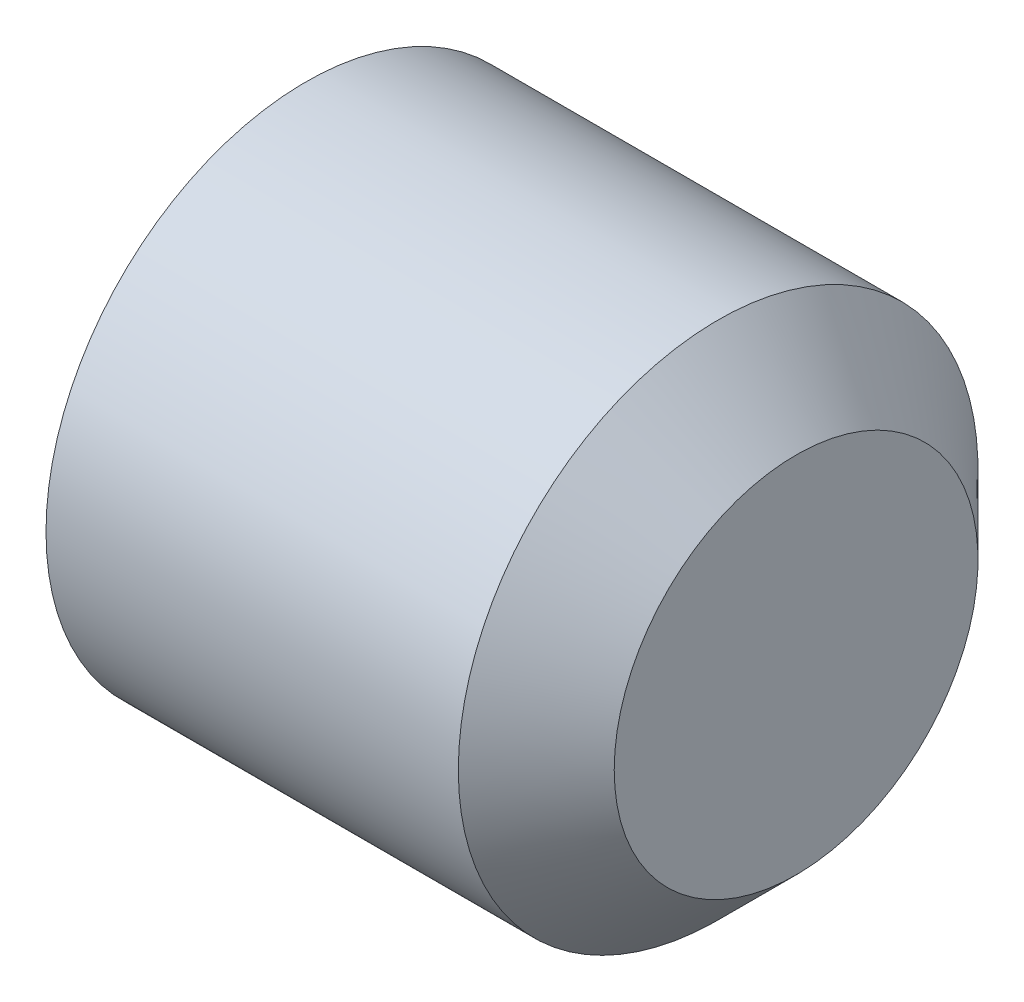
ISO-10303-21;
HEADER;
FILE_DESCRIPTION(('STEP AP214'),'2;1');
FILE_NAME('part.step','',(''),(''),'','','');
FILE_SCHEMA(('AUTOMOTIVE_DESIGN { 1 0 10303 214 1 1 1 1 }'));
ENDSEC;
DATA;
#1=APPLICATION_CONTEXT('core data for automotive mechanical design processes');
#2=APPLICATION_PROTOCOL_DEFINITION('international standard','automotive_design',2000,#1);
#3=PRODUCT_CONTEXT('',#1,'mechanical');
#4=PRODUCT('Part','Part','',(#3));
#5=PRODUCT_RELATED_PRODUCT_CATEGORY('part','',(#4));
#6=PRODUCT_DEFINITION_FORMATION('','',#4);
#7=PRODUCT_DEFINITION_CONTEXT('part definition',#1,'design');
#8=PRODUCT_DEFINITION('design','',#6,#7);
#9=PRODUCT_DEFINITION_SHAPE('','',#8);
#10=(LENGTH_UNIT() NAMED_UNIT(*) SI_UNIT(.MILLI.,.METRE.));
#11=(NAMED_UNIT(*) PLANE_ANGLE_UNIT() SI_UNIT($,.RADIAN.));
#12=(NAMED_UNIT(*) SI_UNIT($,.STERADIAN.) SOLID_ANGLE_UNIT());
#13=UNCERTAINTY_MEASURE_WITH_UNIT(LENGTH_MEASURE(1.E-05),#10,'distance_accuracy_value','');
#14=(GEOMETRIC_REPRESENTATION_CONTEXT(3) GLOBAL_UNCERTAINTY_ASSIGNED_CONTEXT((#13)) GLOBAL_UNIT_ASSIGNED_CONTEXT((#10,
#11,#12)) REPRESENTATION_CONTEXT('',''));
#15=CARTESIAN_POINT('',(0.,0.,0.));
#16=DIRECTION('',(0.,0.,1.));
#17=DIRECTION('',(1.,0.,0.));
#18=AXIS2_PLACEMENT_3D('',#15,#16,#17);
#19=CARTESIAN_POINT('',(0.83333333333333,0.,0.));
#20=DIRECTION('',(-1.,0.,0.));
#21=DIRECTION('',(0.,0.,1.));
#22=AXIS2_PLACEMENT_3D('',#19,#20,#21);
#23=CONICAL_SURFACE('',#22,0.,1.04719755119661);
#24=CARTESIAN_POINT('',(0.,0.,0.));
#25=DIRECTION('',(-1.,0.,0.));
#26=DIRECTION('',(0.,0.,1.));
#27=AXIS2_PLACEMENT_3D('',#24,#25,#26);
#28=CIRCLE('',#27,1.4433756729741);
#29=CARTESIAN_POINT('',(0.,0.,1.4433756729741));
#30=VERTEX_POINT('',#29);
#31=CARTESIAN_POINT('',(0.,1.25000000000003,0.721687836487051));
#32=VERTEX_POINT('',#31);
#33=EDGE_CURVE('E135',#30,#32,#28,.T.);
#34=ORIENTED_EDGE('',*,*,#33,.T.);
#35=CARTESIAN_POINT('',(-6.66746660219313E-05,1.25020000000002,0.721572366433221));
#36=CARTESIAN_POINT('',(0.0182540852363146,1.19526669476825,0.753288124996257));
#37=CARTESIAN_POINT('',(0.0349166937993671,1.13985921349977,0.78527764922173));
#38=CARTESIAN_POINT('',(0.0640026960542333,1.02808463239967,0.849810733708432));
#39=CARTESIAN_POINT('',(0.0764157980239526,0.971715545158301,0.882355441401211));
#40=CARTESIAN_POINT('',(0.0957403123639898,0.859676025913025,0.947041487997347));
#41=CARTESIAN_POINT('',(0.102780310552569,0.804022841540779,0.979172868975923));
#42=CARTESIAN_POINT('',(0.111187567369367,0.692454346091615,1.04358696985658));
#43=CARTESIAN_POINT('',(0.112561784795276,0.636539441062406,1.07586945532691));
#44=CARTESIAN_POINT('',(0.109716662632079,0.532042078818279,1.13620103554816));
#45=CARTESIAN_POINT('',(0.106195901179983,0.483444050118688,1.16425912049995));
#46=CARTESIAN_POINT('',(0.0950328873007429,0.386564637826765,1.22019247526563));
#47=CARTESIAN_POINT('',(0.0873868144273217,0.33828358980784,1.24806755133611));
#48=CARTESIAN_POINT('',(0.0682705452994674,0.241204116145959,1.30411641158758));
#49=CARTESIAN_POINT('',(0.0567192430203415,0.192417989648102,1.33228309485384));
#50=CARTESIAN_POINT('',(0.0305016853061078,0.095573747707899,1.38819614400748));
#51=CARTESIAN_POINT('',(0.0158415978608937,0.0475143896730363,1.41594322730599));
#52=CARTESIAN_POINT('',(-6.66746660267736E-05,-0.000200000000000035,1.44349114302794));
#53=B_SPLINE_CURVE_WITH_KNOTS('',3,(#35,#36,#37,#38,#39,#40,#41,#42,#43,#44,#45,#46,#47,#48,#49,
#50,#51,#52),.UNSPECIFIED.,.F.,.F.,(4,2,2,2,2,2,2,2,4),(0.,0.198150821029562,0.396778196315227,
0.590488617354409,0.783961049317194,0.95248005639866,1.12115539730011,1.29357430343591,
1.46565426976932),.UNSPECIFIED.);
#54=EDGE_CURVE('E11',#32,#30,#53,.T.);
#55=ORIENTED_EDGE('',*,*,#54,.T.);
#56=EDGE_LOOP('',(#34,#55));
#57=FACE_BOUND('',#56,.T.);
#58=ADVANCED_FACE('F36',(#57),#23,.F.);
#59=CARTESIAN_POINT('',(0.,-1.25000000000002,0.721687836487058));
#60=VERTEX_POINT('',#59);
#61=EDGE_CURVE('E134',#60,#30,#28,.T.);
#62=ORIENTED_EDGE('',*,*,#61,.T.);
#63=CARTESIAN_POINT('',(-6.66746660268099E-05,0.000199999999999981,1.44349114302794));
#64=CARTESIAN_POINT('',(0.0182540852363098,-0.0547333052317663,1.4117753844649));
#65=CARTESIAN_POINT('',(0.0349166937993627,-0.110140786500242,1.37978586023943));
#66=CARTESIAN_POINT('',(0.06400269605423,-0.221915367600345,1.31525277575273));
#67=CARTESIAN_POINT('',(0.0764157980239499,-0.278284454841716,1.28270806805995));
#68=CARTESIAN_POINT('',(0.0957403123639879,-0.390323974086993,1.21802202146381));
#69=CARTESIAN_POINT('',(0.102780310552568,-0.445977158459239,1.18589064048523));
#70=CARTESIAN_POINT('',(0.111187567369366,-0.557545653908403,1.12147653960458));
#71=CARTESIAN_POINT('',(0.112561784795275,-0.613460558937613,1.08919405413425));
#72=CARTESIAN_POINT('',(0.10971666263208,-0.717957921181739,1.028862473913));
#73=CARTESIAN_POINT('',(0.106195901179984,-0.76655594988133,1.0008043889612));
#74=CARTESIAN_POINT('',(0.0950328873007448,-0.863435362173253,0.94487103419553));
#75=CARTESIAN_POINT('',(0.087386814427324,-0.911716410192178,0.916995958125047));
#76=CARTESIAN_POINT('',(0.0682705452994706,-1.00879588385406,0.860947097873573));
#77=CARTESIAN_POINT('',(0.0567192430203451,-1.05758201035191,0.832780414607316));
#78=CARTESIAN_POINT('',(0.0305016853061119,-1.15442625229212,0.776867365453675));
#79=CARTESIAN_POINT('',(0.0158415978608981,-1.20248561032698,0.749120282155167));
#80=CARTESIAN_POINT('',(-6.66746660219481E-05,-1.25020000000002,0.721572366433221));
#81=B_SPLINE_CURVE_WITH_KNOTS('',3,(#63,#64,#65,#66,#67,#68,#69,#70,#71,#72,#73,#74,#75,#76,#77,
#78,#79,#80),.UNSPECIFIED.,.F.,.F.,(4,2,2,2,2,2,2,2,4),(0.,0.198150821029564,0.396778196315229,
0.590488617354412,0.783961049317198,0.952480056398663,1.12115539730011,1.29357430343592,
1.46565426976932),.UNSPECIFIED.);
#82=EDGE_CURVE('E50',#30,#60,#81,.T.);
#83=ORIENTED_EDGE('',*,*,#82,.T.);
#84=EDGE_LOOP('',(#62,#83));
#85=FACE_BOUND('',#84,.T.);
#86=ADVANCED_FACE('F210',(#85),#23,.F.);
#87=CARTESIAN_POINT('',(0.,-1.25000000000002,-0.721687836487002));
#88=VERTEX_POINT('',#87);
#89=EDGE_CURVE('E238',#88,#60,#28,.T.);
#90=ORIENTED_EDGE('',*,*,#89,.T.);
#91=CARTESIAN_POINT('',(-0.464794110924291,-1.25000000000002,-1.86893140179214));
#92=CARTESIAN_POINT('',(-0.438896838466478,-1.25000000000002,-1.81495202267021));
#93=CARTESIAN_POINT('',(-0.413268621931145,-1.25000000000002,-1.76084125344193));
#94=CARTESIAN_POINT('',(-0.362702760613349,-1.25000000000002,-1.65228662652063));
#95=CARTESIAN_POINT('',(-0.33776524011027,-1.25000000000002,-1.59784271100764));
#96=CARTESIAN_POINT('',(-0.288593916349793,-1.25000000000002,-1.48823931692672));
#97=CARTESIAN_POINT('',(-0.264365299486762,-1.25000000000002,-1.43307750108904));
#98=CARTESIAN_POINT('',(-0.216995070503878,-1.25000000000002,-1.32229188443617));
#99=CARTESIAN_POINT('',(-0.193853401864485,-1.25000000000002,-1.26666810781958));
#100=CARTESIAN_POINT('',(-0.148354613067776,-1.25000000000002,-1.15340083047604));
#101=CARTESIAN_POINT('',(-0.126033815465273,-1.25000000000002,-1.09574254265112));
#102=CARTESIAN_POINT('',(-0.0832554769119631,-1.25000000000002,-0.979741082890144));
#103=CARTESIAN_POINT('',(-0.0627981694396674,-1.25000000000002,-0.921397826164608));
#104=CARTESIAN_POINT('',(-0.0050842376761978,-1.25000000000002,-0.745435524772212));
#105=CARTESIAN_POINT('',(0.0286497850231123,-1.25000000000002,-0.626561938132833));
#106=CARTESIAN_POINT('',(0.0677795931717858,-1.25000000000002,-0.445873083681213));
#107=CARTESIAN_POINT('',(0.0789059393811671,-1.25000000000002,-0.385304700192742));
#108=CARTESIAN_POINT('',(0.0965721477324202,-1.25000000000002,-0.263486592065004));
#109=CARTESIAN_POINT('',(0.103112319816829,-1.25000000000002,-0.20223691375322));
#110=CARTESIAN_POINT('',(0.111001218957217,-1.25000000000002,-0.0801324468775579));
#111=CARTESIAN_POINT('',(0.112411208741836,-1.25000000000002,-0.0192817197886894));
#112=CARTESIAN_POINT('',(0.110083812113801,-1.25000000000002,0.10231923270118));
#113=CARTESIAN_POINT('',(0.106346106973961,-1.25000000000002,0.163069451645888));
#114=CARTESIAN_POINT('',(0.0911019719638621,-1.25000000000002,0.312961598922957));
#115=CARTESIAN_POINT('',(0.0767387515703043,-1.25000000000002,0.401813055628298));
#116=CARTESIAN_POINT('',(0.0397001504850595,-1.25000000000002,0.577788146583247));
#117=CARTESIAN_POINT('',(0.0170147516458518,-1.25000000000002,0.664909564430803));
#118=CARTESIAN_POINT('',(-0.0217374532821383,-1.25000000000002,0.795209224728854));
#119=CARTESIAN_POINT('',(-0.035622944810274,-1.25000000000002,0.839061001813599));
#120=CARTESIAN_POINT('',(-0.0646784153621271,-1.25000000000002,0.926308087474023));
#121=CARTESIAN_POINT('',(-0.0798475927664454,-1.25000000000002,0.969703662172532));
#122=CARTESIAN_POINT('',(-0.111250133996567,-1.25000000000002,1.05609633508801));
#123=CARTESIAN_POINT('',(-0.127483304422994,-1.25000000000002,1.09909350410941));
#124=CARTESIAN_POINT('',(-0.160838243910796,-1.25000000000002,1.18474903910488));
#125=CARTESIAN_POINT('',(-0.177960163104354,-1.25000000000002,1.22740734642408));
#126=CARTESIAN_POINT('',(-0.222761429232148,-1.25000000000002,1.33629459550834));
#127=CARTESIAN_POINT('',(-0.250969383573535,-1.25000000000002,1.40230581092037));
#128=CARTESIAN_POINT('',(-0.308745081158495,-1.25000000000002,1.53373213594221));
#129=CARTESIAN_POINT('',(-0.338312926269929,-1.25000000000002,1.59914720045383));
#130=CARTESIAN_POINT('',(-0.428576920024401,-1.25000000000002,1.79469680395951));
#131=CARTESIAN_POINT('',(-0.490824273185201,-1.25000000000002,1.92411390982377));
#132=CARTESIAN_POINT('',(-0.617929622902747,-1.25000000000002,2.18184246876945));
#133=CARTESIAN_POINT('',(-0.682790734765051,-1.25000000000002,2.3101523670367));
#134=CARTESIAN_POINT('',(-0.814180745531451,-1.25000000000002,2.56589305685464));
#135=CARTESIAN_POINT('',(-0.88070943244268,-1.25000000000002,2.69332395754896));
#136=CARTESIAN_POINT('',(-1.00858200164583,-1.25000000000002,2.9355782630183));
#137=CARTESIAN_POINT('',(-1.06982257041218,-1.25000000000002,3.05045639113084));
#138=CARTESIAN_POINT('',(-1.19300148004091,-1.25000000000002,3.27984311898864));
#139=CARTESIAN_POINT('',(-1.25493984672615,-1.25000000000002,3.39435170485547));
#140=CARTESIAN_POINT('',(-1.37918115605613,-1.25000000000002,3.62279327872177));
#141=CARTESIAN_POINT('',(-1.44148277067595,-1.25000000000002,3.73672698995322));
#142=CARTESIAN_POINT('',(-1.56649149193147,-1.25000000000002,3.96436406629504));
#143=CARTESIAN_POINT('',(-1.62919857717611,-1.25000000000002,4.07806744314797));
#144=CARTESIAN_POINT('',(-1.69205434936231,-1.25000000000002,4.19168806612963));
#145=B_SPLINE_CURVE_WITH_KNOTS('',3,(#91,#92,#93,#94,#95,#96,#97,#98,#99,#100,#101,#102,#103,
#104,#105,#106,#107,#108,#109,#110,#111,#112,#113,#114,#115,#116,#117,#118,#119,#120,#121,#122,
#123,#124,#125,#126,#127,#128,#129,#130,#131,#132,#133,#134,#135,#136,#137,#138,#139,#140,#141,
#142,#143,#144),.UNSPECIFIED.,.F.,.F.,(4,2,2,2,2,2,2,2,2,2,2,2,2,2,2,2,2,2,2,2,2,2,2,2,2,2,4),
(0.,0.179612926712515,0.359257964580623,0.539992735616906,0.72071809831121,0.906167781883872,
1.09164066876278,1.46154014621248,1.64614554413146,1.83073846485711,2.01311967401939,
2.19551217609306,2.46497297688035,2.73475922178119,2.87273702323332,3.01062928909401,
3.14849655975691,3.28638719597095,3.50172172546914,3.71707241178645,4.1478449134987,
4.57914698286387,5.01039449766874,5.40093821140482,5.79149642546543,6.18106124184776,
6.57060567131897),.UNSPECIFIED.);
#146=EDGE_CURVE('E184',#60,#88,#145,.F.);
#147=ORIENTED_EDGE('',*,*,#146,.T.);
#148=EDGE_LOOP('',(#90,#147));
#149=FACE_BOUND('',#148,.T.);
#150=ADVANCED_FACE('F216',(#149),#23,.F.);
#151=CARTESIAN_POINT('',(0.,0.,-1.44337567297404));
#152=VERTEX_POINT('',#151);
#153=EDGE_CURVE('E236',#152,#88,#28,.T.);
#154=ORIENTED_EDGE('',*,*,#153,.T.);
#155=CARTESIAN_POINT('',(-6.66746660057022E-05,-1.25020000000002,-0.721572366433164));
#156=CARTESIAN_POINT('',(0.0182540852363312,-1.19526669476825,-0.753288124996199));
#157=CARTESIAN_POINT('',(0.0349166937993845,-1.13985921349978,-0.785277649221672));
#158=CARTESIAN_POINT('',(0.0640026960542528,-1.02808463239968,-0.849810733708372));
#159=CARTESIAN_POINT('',(0.0764157980239733,-0.971715545158308,-0.882355441401151));
#160=CARTESIAN_POINT('',(0.0957403123640127,-0.859676025913034,-0.947041487997285));
#161=CARTESIAN_POINT('',(0.102780310552593,-0.80402284154079,-0.979172868975861));
#162=CARTESIAN_POINT('',(0.111187567369394,-0.692454346091628,-1.04358696985652));
#163=CARTESIAN_POINT('',(0.112561784795304,-0.63653944106242,-1.07586945532684));
#164=CARTESIAN_POINT('',(0.10971666263211,-0.532042078818294,-1.13620103554809));
#165=CARTESIAN_POINT('',(0.106195901180015,-0.483444050118702,-1.16425912049989));
#166=CARTESIAN_POINT('',(0.0950328873007757,-0.386564637826775,-1.22019247526556));
#167=CARTESIAN_POINT('',(0.087386814427355,-0.338283589807849,-1.24806755133605));
#168=CARTESIAN_POINT('',(0.0682705452995012,-0.241204116145966,-1.30411641158752));
#169=CARTESIAN_POINT('',(0.0567192430203753,-0.192417989648107,-1.33228309485378));
#170=CARTESIAN_POINT('',(0.0305016853061413,-0.0955737477079013,-1.38819614400743));
#171=CARTESIAN_POINT('',(0.0158415978609268,-0.0475143896730374,-1.41594322730593));
#172=CARTESIAN_POINT('',(-6.66746659940686E-05,0.000200000000000096,-1.44349114302788));
#173=B_SPLINE_CURVE_WITH_KNOTS('',3,(#155,#156,#157,#158,#159,#160,#161,#162,#163,#164,#165,
#166,#167,#168,#169,#170,#171,#172),.UNSPECIFIED.,.F.,.F.,(4,2,2,2,2,2,2,2,4),(0.,
0.198150821029559,0.396778196315219,0.590488617354397,0.783961049317178,0.952480056398648,
1.1211553973001,1.29357430343591,1.46565426976932),.UNSPECIFIED.);
#174=EDGE_CURVE('E178',#88,#152,#173,.T.);
#175=ORIENTED_EDGE('',*,*,#174,.T.);
#176=EDGE_LOOP('',(#154,#175));
#177=FACE_BOUND('',#176,.T.);
#178=ADVANCED_FACE('F227',(#177),#23,.F.);
#179=CARTESIAN_POINT('',(0.,1.25000000000002,-0.721687836487002));
#180=VERTEX_POINT('',#179);
#181=EDGE_CURVE('E234',#180,#152,#28,.T.);
#182=ORIENTED_EDGE('',*,*,#181,.T.);
#183=CARTESIAN_POINT('',(-6.66746659941212E-05,-0.000199999999999926,-1.44349114302788));
#184=CARTESIAN_POINT('',(0.0182540852363418,0.0547333052317643,-1.41177538446485));
#185=CARTESIAN_POINT('',(0.034916693799394,0.110140786500238,-1.37978586023937));
#186=CARTESIAN_POINT('',(0.0640026960542601,0.221915367600336,-1.31525277575267));
#187=CARTESIAN_POINT('',(0.0764157980239795,0.278284454841706,-1.2827080680599));
#188=CARTESIAN_POINT('',(0.0957403123640169,0.390323974086978,-1.21802202146376));
#189=CARTESIAN_POINT('',(0.102780310552596,0.445977158459222,-1.18589064048519));
#190=CARTESIAN_POINT('',(0.111187567369395,0.557545653908382,-1.12147653960453));
#191=CARTESIAN_POINT('',(0.112561784795304,0.613460558937589,-1.08919405413421));
#192=CARTESIAN_POINT('',(0.109716662632108,0.717957921181716,-1.02886247391296));
#193=CARTESIAN_POINT('',(0.106195901180012,0.766555949881308,-1.00080438896116));
#194=CARTESIAN_POINT('',(0.0950328873007713,0.863435362173236,-0.944871034195484));
#195=CARTESIAN_POINT('',(0.0873868144273497,0.911716410192163,-0.916995958124999));
#196=CARTESIAN_POINT('',(0.0682705452994941,1.00879588385405,-0.860947097873523));
#197=CARTESIAN_POINT('',(0.0567192430203673,1.05758201035191,-0.832780414607265));
#198=CARTESIAN_POINT('',(0.0305016853061314,1.15442625229211,-0.776867365453621));
#199=CARTESIAN_POINT('',(0.015841597860916,1.20248561032698,-0.749120282155111));
#200=CARTESIAN_POINT('',(-6.66746660057401E-05,1.25020000000002,-0.721572366433164));
#201=B_SPLINE_CURVE_WITH_KNOTS('',3,(#183,#184,#185,#186,#187,#188,#189,#190,#191,#192,#193,
#194,#195,#196,#197,#198,#199,#200),.UNSPECIFIED.,.F.,.F.,(4,2,2,2,2,2,2,2,4),(0.,
0.198150821029556,0.396778196315213,0.590488617354389,0.783961049317167,0.952480056398639,
1.1211553973001,1.29357430343591,1.46565426976932),.UNSPECIFIED.);
#202=EDGE_CURVE('E117',#152,#180,#201,.T.);
#203=ORIENTED_EDGE('',*,*,#202,.T.);
#204=EDGE_LOOP('',(#182,#203));
#205=FACE_BOUND('',#204,.T.);
#206=ADVANCED_FACE('F219',(#205),#23,.F.);
#207=EDGE_CURVE('E139',#32,#180,#28,.T.);
#208=ORIENTED_EDGE('',*,*,#207,.T.);
#209=CARTESIAN_POINT('',(-0.464794110924292,1.25000000000002,-1.86893140179214));
#210=CARTESIAN_POINT('',(-0.438896838466478,1.25000000000002,-1.81495202267022));
#211=CARTESIAN_POINT('',(-0.413268621931146,1.25000000000002,-1.76084125344193));
#212=CARTESIAN_POINT('',(-0.36270276061335,1.25000000000002,-1.65228662652063));
#213=CARTESIAN_POINT('',(-0.337765240110271,1.25000000000002,-1.59784271100764));
#214=CARTESIAN_POINT('',(-0.288593916349794,1.25000000000002,-1.48823931692672));
#215=CARTESIAN_POINT('',(-0.264365299486763,1.25000000000002,-1.43307750108904));
#216=CARTESIAN_POINT('',(-0.216995070503879,1.25000000000002,-1.32229188443617));
#217=CARTESIAN_POINT('',(-0.193853401864486,1.25000000000002,-1.26666810781959));
#218=CARTESIAN_POINT('',(-0.148354613067777,1.25000000000002,-1.15340083047605));
#219=CARTESIAN_POINT('',(-0.126033815465273,1.25000000000002,-1.09574254265112));
#220=CARTESIAN_POINT('',(-0.0832554769119634,1.25000000000002,-0.979741082890145));
#221=CARTESIAN_POINT('',(-0.0627981694396679,1.25000000000002,-0.921397826164609));
#222=CARTESIAN_POINT('',(-0.00508423767619826,1.25000000000002,-0.745435524772213));
#223=CARTESIAN_POINT('',(0.0286497850231121,1.25000000000002,-0.626561938132834));
#224=CARTESIAN_POINT('',(0.0677795931717858,1.25000000000002,-0.445873083681214));
#225=CARTESIAN_POINT('',(0.078905939381167,1.25000000000002,-0.385304700192742));
#226=CARTESIAN_POINT('',(0.0965721477324201,1.25000000000002,-0.263486592065004));
#227=CARTESIAN_POINT('',(0.103112319816829,1.25000000000002,-0.20223691375322));
#228=CARTESIAN_POINT('',(0.111001218957217,1.25000000000002,-0.0801324468775577));
#229=CARTESIAN_POINT('',(0.112411208741836,1.25000000000002,-0.0192817197886892));
#230=CARTESIAN_POINT('',(0.1100838121138,1.25000000000002,0.10231923270118));
#231=CARTESIAN_POINT('',(0.106346106973961,1.25000000000002,0.163069451645888));
#232=CARTESIAN_POINT('',(0.0911019719638621,1.25000000000002,0.312961598922957));
#233=CARTESIAN_POINT('',(0.0767387515703042,1.25000000000002,0.401813055628298));
#234=CARTESIAN_POINT('',(0.0397001504850594,1.25000000000002,0.577788146583247));
#235=CARTESIAN_POINT('',(0.0170147516458518,1.25000000000002,0.664909564430803));
#236=CARTESIAN_POINT('',(-0.0217374532821382,1.25000000000002,0.795209224728853));
#237=CARTESIAN_POINT('',(-0.0356229448102739,1.25000000000002,0.839061001813598));
#238=CARTESIAN_POINT('',(-0.064678415362127,1.25000000000002,0.926308087474023));
#239=CARTESIAN_POINT('',(-0.0798475927664451,1.25000000000002,0.969703662172532));
#240=CARTESIAN_POINT('',(-0.111250133996567,1.25000000000002,1.05609633508801));
#241=CARTESIAN_POINT('',(-0.127483304422994,1.25000000000002,1.09909350410941));
#242=CARTESIAN_POINT('',(-0.160838243910796,1.25000000000002,1.18474903910488));
#243=CARTESIAN_POINT('',(-0.177960163104354,1.25000000000002,1.22740734642408));
#244=CARTESIAN_POINT('',(-0.222761429232148,1.25000000000002,1.33629459550834));
#245=CARTESIAN_POINT('',(-0.250969383573535,1.25000000000002,1.40230581092037));
#246=CARTESIAN_POINT('',(-0.308745081158495,1.25000000000002,1.53373213594221));
#247=CARTESIAN_POINT('',(-0.338312926269929,1.25000000000002,1.59914720045383));
#248=CARTESIAN_POINT('',(-0.428576920024401,1.25000000000002,1.79469680395951));
#249=CARTESIAN_POINT('',(-0.490824273185202,1.25000000000002,1.92411390982377));
#250=CARTESIAN_POINT('',(-0.617929622902748,1.25000000000002,2.18184246876945));
#251=CARTESIAN_POINT('',(-0.682790734765051,1.25000000000002,2.3101523670367));
#252=CARTESIAN_POINT('',(-0.814180745531452,1.25000000000002,2.56589305685464));
#253=CARTESIAN_POINT('',(-0.880709432442681,1.25000000000002,2.69332395754896));
#254=CARTESIAN_POINT('',(-1.00858200164583,1.25000000000002,2.9355782630183));
#255=CARTESIAN_POINT('',(-1.06982257041218,1.25000000000002,3.05045639113084));
#256=CARTESIAN_POINT('',(-1.19300148004091,1.25000000000002,3.27984311898864));
#257=CARTESIAN_POINT('',(-1.25493984672615,1.25000000000002,3.39435170485547));
#258=CARTESIAN_POINT('',(-1.37918115605613,1.25000000000002,3.62279327872177));
#259=CARTESIAN_POINT('',(-1.44148277067595,1.25000000000002,3.73672698995322));
#260=CARTESIAN_POINT('',(-1.56649149193147,1.25000000000002,3.96436406629504));
#261=CARTESIAN_POINT('',(-1.62919857717611,1.25000000000002,4.07806744314797));
#262=CARTESIAN_POINT('',(-1.69205434936231,1.25000000000002,4.19168806612963));
#263=B_SPLINE_CURVE_WITH_KNOTS('',3,(#209,#210,#211,#212,#213,#214,#215,#216,#217,#218,#219,
#220,#221,#222,#223,#224,#225,#226,#227,#228,#229,#230,#231,#232,#233,#234,#235,#236,#237,#238,
#239,#240,#241,#242,#243,#244,#245,#246,#247,#248,#249,#250,#251,#252,#253,#254,#255,#256,#257,
#258,#259,#260,#261,#262),.UNSPECIFIED.,.F.,.F.,(4,2,2,2,2,2,2,2,2,2,2,2,2,2,2,2,2,2,2,2,2,2,2,
2,2,2,4),(0.,0.179612926712515,0.359257964580622,0.539992735616905,0.720718098311209,
0.906167781883871,1.09164066876278,1.46154014621248,1.64614554413146,1.83073846485711,
2.01311967401939,2.19551217609306,2.46497297688035,2.73475922178119,2.87273702323332,
3.01062928909401,3.14849655975691,3.28638719597095,3.50172172546914,3.71707241178645,
4.1478449134987,4.57914698286387,5.01039449766874,5.40093821140482,5.79149642546544,
6.18106124184776,6.57060567131898),.UNSPECIFIED.);
#264=EDGE_CURVE('E83',#180,#32,#263,.T.);
#265=ORIENTED_EDGE('',*,*,#264,.T.);
#266=EDGE_LOOP('',(#208,#265));
#267=FACE_BOUND('',#266,.T.);
#268=ADVANCED_FACE('F212',(#267),#23,.F.);
#269=CARTESIAN_POINT('',(5.,0.,0.));
#270=DIRECTION('',(1.,0.,0.));
#271=DIRECTION('',(0.,0.,-1.));
#272=AXIS2_PLACEMENT_3D('',#269,#270,#271);
#273=PLANE('',#272);
#274=CARTESIAN_POINT('',(5.,0.,0.));
#275=DIRECTION('',(-1.,0.,0.));
#276=DIRECTION('',(0.,0.,1.));
#277=AXIS2_PLACEMENT_3D('',#274,#275,#276);
#278=CIRCLE('',#277,1.75);
#279=CARTESIAN_POINT('',(5.,0.,1.75));
#280=VERTEX_POINT('',#279);
#281=EDGE_CURVE('E148',#280,#280,#278,.T.);
#282=ORIENTED_EDGE('',*,*,#281,.F.);
#283=EDGE_LOOP('',(#282));
#284=FACE_BOUND('',#283,.T.);
#285=ADVANCED_FACE('F38',(#284),#273,.T.);
#286=CARTESIAN_POINT('',(4.25,0.,0.));
#287=DIRECTION('',(-1.,0.,0.));
#288=DIRECTION('',(0.,0.,1.));
#289=AXIS2_PLACEMENT_3D('',#286,#287,#288);
#290=CONICAL_SURFACE('',#289,2.5,0.785398163397449);
#291=ORIENTED_EDGE('',*,*,#281,.T.);
#292=EDGE_LOOP('',(#291));
#293=FACE_BOUND('',#292,.T.);
#294=CARTESIAN_POINT('',(4.25,0.,0.));
#295=DIRECTION('',(-1.,0.,0.));
#296=DIRECTION('',(0.,0.,1.));
#297=AXIS2_PLACEMENT_3D('',#294,#295,#296);
#298=CIRCLE('',#297,2.5);
#299=CARTESIAN_POINT('',(4.25,0.,2.5));
#300=VERTEX_POINT('',#299);
#301=EDGE_CURVE('E145',#300,#300,#298,.T.);
#302=ORIENTED_EDGE('',*,*,#301,.F.);
#303=EDGE_LOOP('',(#302));
#304=FACE_BOUND('',#303,.T.);
#305=ADVANCED_FACE('F225',(#293,#304),#290,.T.);
#306=CARTESIAN_POINT('',(0.83333333333333,0.,0.));
#307=DIRECTION('',(-1.,0.,0.));
#308=DIRECTION('',(0.,0.,1.));
#309=AXIS2_PLACEMENT_3D('',#306,#307,#308);
#310=CYLINDRICAL_SURFACE('',#309,2.5);
#311=ORIENTED_EDGE('',*,*,#301,.T.);
#312=EDGE_LOOP('',(#311));
#313=FACE_BOUND('',#312,.T.);
#314=CARTESIAN_POINT('',(0.28319030703751,0.,0.));
#315=DIRECTION('',(-1.,0.,0.));
#316=DIRECTION('',(0.,0.,1.));
#317=AXIS2_PLACEMENT_3D('',#314,#315,#316);
#318=CIRCLE('',#317,2.5);
#319=CARTESIAN_POINT('',(0.28319030703751,0.,2.5));
#320=VERTEX_POINT('',#319);
#321=EDGE_CURVE('E142',#320,#320,#318,.T.);
#322=ORIENTED_EDGE('',*,*,#321,.F.);
#323=EDGE_LOOP('',(#322));
#324=FACE_BOUND('',#323,.T.);
#325=ADVANCED_FACE('F288',(#313,#324),#310,.T.);
#326=CARTESIAN_POINT('',(0.,0.,0.));
#327=DIRECTION('',(1.,0.,0.));
#328=DIRECTION('',(0.,0.,-1.));
#329=AXIS2_PLACEMENT_3D('',#326,#327,#328);
#330=CONICAL_SURFACE('',#329,2.0095,1.0471975511966);
#331=ORIENTED_EDGE('',*,*,#321,.T.);
#332=EDGE_LOOP('',(#331));
#333=FACE_BOUND('',#332,.T.);
#334=CARTESIAN_POINT('',(0.,0.,0.));
#335=DIRECTION('',(-1.,0.,0.));
#336=DIRECTION('',(0.,0.,1.));
#337=AXIS2_PLACEMENT_3D('',#334,#335,#336);
#338=CIRCLE('',#337,2.0095);
#339=CARTESIAN_POINT('',(0.,0.,2.0095));
#340=VERTEX_POINT('',#339);
#341=EDGE_CURVE('E138',#340,#340,#338,.T.);
#342=ORIENTED_EDGE('',*,*,#341,.F.);
#343=EDGE_LOOP('',(#342));
#344=FACE_BOUND('',#343,.T.);
#345=ADVANCED_FACE('F207',(#333,#344),#330,.T.);
#346=CARTESIAN_POINT('',(0.,-2.0095,0.));
#347=DIRECTION('',(-1.,0.,0.));
#348=DIRECTION('',(0.,0.,1.));
#349=AXIS2_PLACEMENT_3D('',#346,#347,#348);
#350=PLANE('',#349);
#351=ORIENTED_EDGE('',*,*,#341,.T.);
#352=EDGE_LOOP('',(#351));
#353=FACE_BOUND('',#352,.T.);
#354=ORIENTED_EDGE('',*,*,#33,.F.);
#355=ORIENTED_EDGE('',*,*,#61,.F.);
#356=ORIENTED_EDGE('',*,*,#89,.F.);
#357=ORIENTED_EDGE('',*,*,#153,.F.);
#358=ORIENTED_EDGE('',*,*,#181,.F.);
#359=ORIENTED_EDGE('',*,*,#207,.F.);
#360=EDGE_LOOP('',(#354,#355,#356,#357,#358,#359));
#361=FACE_BOUND('',#360,.T.);
#362=ADVANCED_FACE('F202',(#353,#361),#350,.T.);
#363=CARTESIAN_POINT('',(2.,1.25000000000002,0.721687836487058));
#364=DIRECTION('',(0.,-0.5,-0.866025403784439));
#365=DIRECTION('',(0.,0.866025403784439,-0.5));
#366=AXIS2_PLACEMENT_3D('',#363,#364,#365);
#367=PLANE('',#366);
#368=DIRECTION('',(-1.,0.,0.));
#369=VECTOR('',#368,1.);
#370=CARTESIAN_POINT('',(2.,1.25000000000002,0.721687836487058));
#371=LINE('',#370,#369);
#372=CARTESIAN_POINT('',(2.,1.25000000000002,0.721687836487058));
#373=VERTEX_POINT('',#372);
#374=EDGE_CURVE('E57',#373,#32,#371,.T.);
#375=ORIENTED_EDGE('',*,*,#374,.F.);
#376=DIRECTION('',(0.,-0.866025403784439,0.5));
#377=VECTOR('',#376,1.);
#378=CARTESIAN_POINT('',(2.,1.25000000000002,0.721687836487058));
#379=LINE('',#378,#377);
#380=CARTESIAN_POINT('',(2.,0.,1.4433756729741));
#381=VERTEX_POINT('',#380);
#382=EDGE_CURVE('E247',#373,#381,#379,.T.);
#383=ORIENTED_EDGE('',*,*,#382,.T.);
#384=DIRECTION('',(-1.,0.,0.));
#385=VECTOR('',#384,1.);
#386=CARTESIAN_POINT('',(2.,0.,1.4433756729741));
#387=LINE('',#386,#385);
#388=EDGE_CURVE('E131',#381,#30,#387,.T.);
#389=ORIENTED_EDGE('',*,*,#388,.T.);
#390=ORIENTED_EDGE('',*,*,#54,.F.);
#391=EDGE_LOOP('',(#375,#383,#389,#390));
#392=FACE_BOUND('',#391,.T.);
#393=ADVANCED_FACE('F198',(#392),#367,.T.);
#394=CARTESIAN_POINT('',(2.,0.,1.4433756729741));
#395=DIRECTION('',(0.,0.5,-0.866025403784439));
#396=DIRECTION('',(0.,0.866025403784439,0.5));
#397=AXIS2_PLACEMENT_3D('',#394,#395,#396);
#398=PLANE('',#397);
#399=ORIENTED_EDGE('',*,*,#388,.F.);
#400=DIRECTION('',(0.,-0.866025403784439,-0.5));
#401=VECTOR('',#400,1.);
#402=CARTESIAN_POINT('',(2.,0.,1.4433756729741));
#403=LINE('',#402,#401);
#404=CARTESIAN_POINT('',(2.,-1.25000000000002,0.721687836487058));
#405=VERTEX_POINT('',#404);
#406=EDGE_CURVE('E92',#381,#405,#403,.T.);
#407=ORIENTED_EDGE('',*,*,#406,.T.);
#408=DIRECTION('',(-1.,0.,0.));
#409=VECTOR('',#408,1.);
#410=CARTESIAN_POINT('',(2.,-1.25000000000002,0.721687836487058));
#411=LINE('',#410,#409);
#412=EDGE_CURVE('E128',#405,#60,#411,.T.);
#413=ORIENTED_EDGE('',*,*,#412,.T.);
#414=ORIENTED_EDGE('',*,*,#82,.F.);
#415=EDGE_LOOP('',(#399,#407,#413,#414));
#416=FACE_BOUND('',#415,.T.);
#417=ADVANCED_FACE('F195',(#416),#398,.T.);
#418=CARTESIAN_POINT('',(2.,-1.25000000000002,0.721687836487058));
#419=DIRECTION('',(0.,1.,0.));
#420=DIRECTION('',(0.,0.,1.));
#421=AXIS2_PLACEMENT_3D('',#418,#419,#420);
#422=PLANE('',#421);
#423=ORIENTED_EDGE('',*,*,#412,.F.);
#424=DIRECTION('',(0.,0.,-1.));
#425=VECTOR('',#424,1.);
#426=CARTESIAN_POINT('',(2.,-1.25000000000002,0.721687836487058));
#427=LINE('',#426,#425);
#428=CARTESIAN_POINT('',(2.,-1.25000000000002,-0.721687836487002));
#429=VERTEX_POINT('',#428);
#430=EDGE_CURVE('E112',#405,#429,#427,.T.);
#431=ORIENTED_EDGE('',*,*,#430,.T.);
#432=DIRECTION('',(-1.,0.,0.));
#433=VECTOR('',#432,1.);
#434=CARTESIAN_POINT('',(2.,-1.25000000000002,-0.721687836487002));
#435=LINE('',#434,#433);
#436=EDGE_CURVE('E109',#429,#88,#435,.T.);
#437=ORIENTED_EDGE('',*,*,#436,.T.);
#438=ORIENTED_EDGE('',*,*,#146,.F.);
#439=EDGE_LOOP('',(#423,#431,#437,#438));
#440=FACE_BOUND('',#439,.T.);
#441=ADVANCED_FACE('F175',(#440),#422,.T.);
#442=CARTESIAN_POINT('',(2.,-1.25000000000002,-0.721687836487002));
#443=DIRECTION('',(0.,0.5,0.866025403784439));
#444=DIRECTION('',(0.,-0.866025403784439,0.5));
#445=AXIS2_PLACEMENT_3D('',#442,#443,#444);
#446=PLANE('',#445);
#447=ORIENTED_EDGE('',*,*,#436,.F.);
#448=DIRECTION('',(0.,0.866025403784439,-0.5));
#449=VECTOR('',#448,1.);
#450=CARTESIAN_POINT('',(2.,-1.25000000000002,-0.721687836487002));
#451=LINE('',#450,#449);
#452=CARTESIAN_POINT('',(2.,0.,-1.44337567297404));
#453=VERTEX_POINT('',#452);
#454=EDGE_CURVE('E103',#429,#453,#451,.T.);
#455=ORIENTED_EDGE('',*,*,#454,.T.);
#456=DIRECTION('',(-1.,0.,0.));
#457=VECTOR('',#456,1.);
#458=CARTESIAN_POINT('',(2.,0.,-1.44337567297404));
#459=LINE('',#458,#457);
#460=EDGE_CURVE('E106',#453,#152,#459,.T.);
#461=ORIENTED_EDGE('',*,*,#460,.T.);
#462=ORIENTED_EDGE('',*,*,#174,.F.);
#463=EDGE_LOOP('',(#447,#455,#461,#462));
#464=FACE_BOUND('',#463,.T.);
#465=ADVANCED_FACE('F105',(#464),#446,.T.);
#466=CARTESIAN_POINT('',(2.,0.,-1.44337567297404));
#467=DIRECTION('',(0.,-0.5,0.866025403784439));
#468=DIRECTION('',(0.,-0.866025403784439,-0.5));
#469=AXIS2_PLACEMENT_3D('',#466,#467,#468);
#470=PLANE('',#469);
#471=ORIENTED_EDGE('',*,*,#460,.F.);
#472=DIRECTION('',(0.,0.866025403784439,0.5));
#473=VECTOR('',#472,1.);
#474=CARTESIAN_POINT('',(2.,0.,-1.44337567297404));
#475=LINE('',#474,#473);
#476=CARTESIAN_POINT('',(2.,1.25000000000002,-0.721687836487002));
#477=VERTEX_POINT('',#476);
#478=EDGE_CURVE('E111',#453,#477,#475,.T.);
#479=ORIENTED_EDGE('',*,*,#478,.T.);
#480=DIRECTION('',(-1.,0.,0.));
#481=VECTOR('',#480,1.);
#482=CARTESIAN_POINT('',(2.,1.25000000000002,-0.721687836487002));
#483=LINE('',#482,#481);
#484=EDGE_CURVE('E118',#477,#180,#483,.T.);
#485=ORIENTED_EDGE('',*,*,#484,.T.);
#486=ORIENTED_EDGE('',*,*,#202,.F.);
#487=EDGE_LOOP('',(#471,#479,#485,#486));
#488=FACE_BOUND('',#487,.T.);
#489=ADVANCED_FACE('F115',(#488),#470,.T.);
#490=CARTESIAN_POINT('',(2.,1.25000000000002,-0.721687836487002));
#491=DIRECTION('',(0.,-1.,0.));
#492=DIRECTION('',(0.,0.,-1.));
#493=AXIS2_PLACEMENT_3D('',#490,#491,#492);
#494=PLANE('',#493);
#495=ORIENTED_EDGE('',*,*,#484,.F.);
#496=DIRECTION('',(0.,0.,1.));
#497=VECTOR('',#496,1.);
#498=CARTESIAN_POINT('',(2.,1.25000000000002,-0.721687836487002));
#499=LINE('',#498,#497);
#500=EDGE_CURVE('E63',#477,#373,#499,.T.);
#501=ORIENTED_EDGE('',*,*,#500,.T.);
#502=ORIENTED_EDGE('',*,*,#374,.T.);
#503=ORIENTED_EDGE('',*,*,#264,.F.);
#504=EDGE_LOOP('',(#495,#501,#502,#503));
#505=FACE_BOUND('',#504,.T.);
#506=ADVANCED_FACE('F165',(#505),#494,.T.);
#507=CARTESIAN_POINT('',(2.,0.,0.));
#508=DIRECTION('',(1.,0.,0.));
#509=DIRECTION('',(0.,0.,-1.));
#510=AXIS2_PLACEMENT_3D('',#507,#508,#509);
#511=PLANE('',#510);
#512=ORIENTED_EDGE('',*,*,#382,.F.);
#513=ORIENTED_EDGE('',*,*,#500,.F.);
#514=ORIENTED_EDGE('',*,*,#478,.F.);
#515=ORIENTED_EDGE('',*,*,#454,.F.);
#516=ORIENTED_EDGE('',*,*,#430,.F.);
#517=ORIENTED_EDGE('',*,*,#406,.F.);
#518=EDGE_LOOP('',(#512,#513,#514,#515,#516,#517));
#519=FACE_BOUND('',#518,.T.);
#520=ADVANCED_FACE('F120',(#519),#511,.F.);
#521=CLOSED_SHELL('',(#58,#86,#150,#178,#206,#268,#285,#305,#325,#345,#362,#393,#417,#441,#465,
#489,#506,#520));
#522=MANIFOLD_SOLID_BREP('B2',#521);
#523=ADVANCED_BREP_SHAPE_REPRESENTATION('',(#18,#522),#14);
#524=SHAPE_DEFINITION_REPRESENTATION(#9,#523);
ENDSEC;
END-ISO-10303-21;
